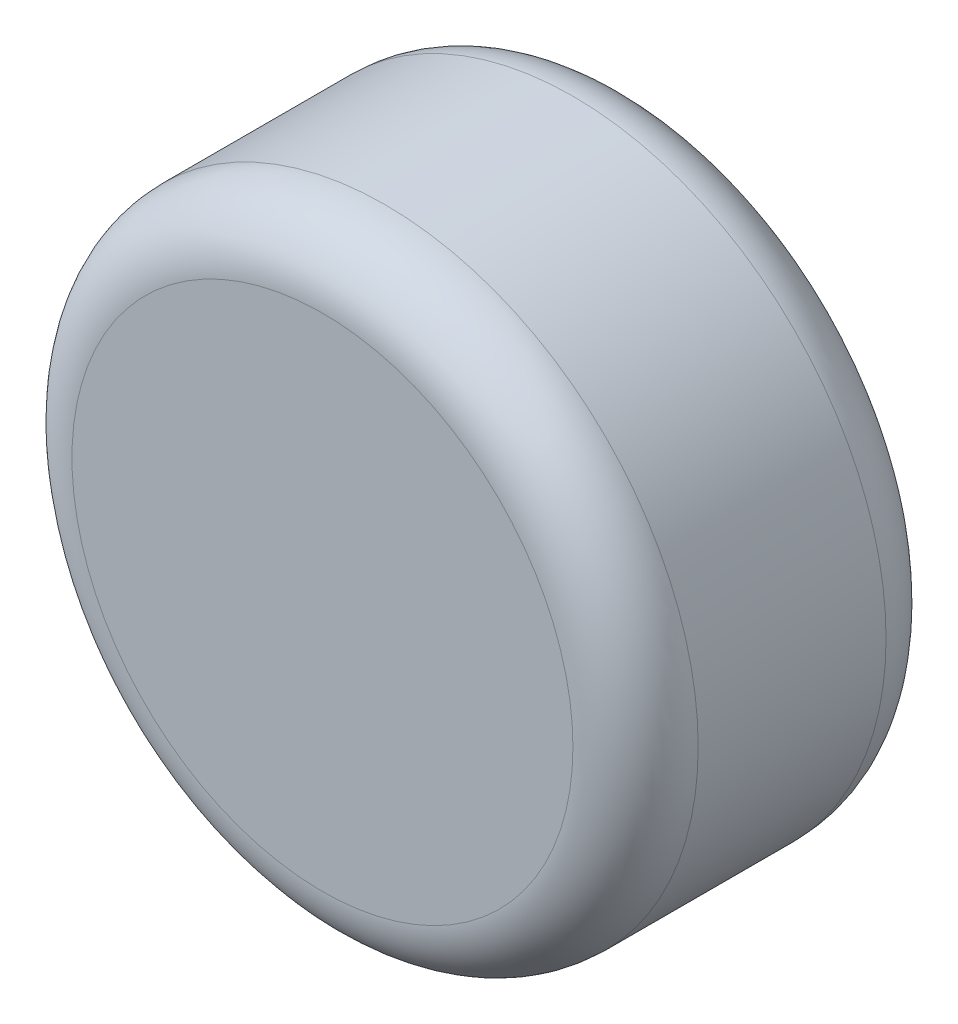
ISO-10303-21;
HEADER;
FILE_DESCRIPTION(('STEP AP214'),'2;1');
FILE_NAME('part.step','',(''),(''),'','','');
FILE_SCHEMA(('AUTOMOTIVE_DESIGN { 1 0 10303 214 1 1 1 1 }'));
ENDSEC;
DATA;
#1=APPLICATION_CONTEXT('core data for automotive mechanical design processes');
#2=APPLICATION_PROTOCOL_DEFINITION('international standard','automotive_design',2000,#1);
#3=PRODUCT_CONTEXT('',#1,'mechanical');
#4=PRODUCT('Part','Part','',(#3));
#5=PRODUCT_RELATED_PRODUCT_CATEGORY('part','',(#4));
#6=PRODUCT_DEFINITION_FORMATION('','',#4);
#7=PRODUCT_DEFINITION_CONTEXT('part definition',#1,'design');
#8=PRODUCT_DEFINITION('design','',#6,#7);
#9=PRODUCT_DEFINITION_SHAPE('','',#8);
#10=(LENGTH_UNIT() NAMED_UNIT(*) SI_UNIT(.MILLI.,.METRE.));
#11=(NAMED_UNIT(*) PLANE_ANGLE_UNIT() SI_UNIT($,.RADIAN.));
#12=(NAMED_UNIT(*) SI_UNIT($,.STERADIAN.) SOLID_ANGLE_UNIT());
#13=UNCERTAINTY_MEASURE_WITH_UNIT(LENGTH_MEASURE(1.E-05),#10,'distance_accuracy_value','');
#14=(GEOMETRIC_REPRESENTATION_CONTEXT(3) GLOBAL_UNCERTAINTY_ASSIGNED_CONTEXT((#13)) GLOBAL_UNIT_ASSIGNED_CONTEXT((#10,
#11,#12)) REPRESENTATION_CONTEXT('',''));
#15=CARTESIAN_POINT('',(0.,0.,0.));
#16=DIRECTION('',(0.,0.,1.));
#17=DIRECTION('',(1.,0.,0.));
#18=AXIS2_PLACEMENT_3D('',#15,#16,#17);
#19=CARTESIAN_POINT('',(0.,0.,50.));
#20=DIRECTION('',(0.,0.,-1.));
#21=DIRECTION('',(-1.,0.,0.));
#22=AXIS2_PLACEMENT_3D('',#19,#20,#21);
#23=CYLINDRICAL_SURFACE('',#22,50.);
#24=CARTESIAN_POINT('',(0.,0.,40.));
#25=DIRECTION('',(0.,0.,1.));
#26=DIRECTION('',(1.,0.,0.));
#27=AXIS2_PLACEMENT_3D('',#24,#25,#26);
#28=CIRCLE('',#27,50.);
#29=CARTESIAN_POINT('',(50.,0.,40.));
#30=VERTEX_POINT('',#29);
#31=EDGE_CURVE('E46',#30,#30,#28,.F.);
#32=ORIENTED_EDGE('',*,*,#31,.T.);
#33=EDGE_LOOP('',(#32));
#34=FACE_BOUND('',#33,.T.);
#35=CARTESIAN_POINT('',(0.,0.,10.));
#36=DIRECTION('',(0.,0.,1.));
#37=DIRECTION('',(1.,0.,0.));
#38=AXIS2_PLACEMENT_3D('',#35,#36,#37);
#39=CIRCLE('',#38,50.);
#40=CARTESIAN_POINT('',(50.,0.,10.));
#41=VERTEX_POINT('',#40);
#42=EDGE_CURVE('E50',#41,#41,#39,.T.);
#43=ORIENTED_EDGE('',*,*,#42,.T.);
#44=EDGE_LOOP('',(#43));
#45=FACE_BOUND('',#44,.T.);
#46=ADVANCED_FACE('F39',(#34,#45),#23,.T.);
#47=CARTESIAN_POINT('',(0.,0.,50.));
#48=DIRECTION('',(0.,0.,1.));
#49=DIRECTION('',(1.,0.,0.));
#50=AXIS2_PLACEMENT_3D('',#47,#48,#49);
#51=PLANE('',#50);
#52=CARTESIAN_POINT('',(0.,0.,50.));
#53=DIRECTION('',(0.,0.,1.));
#54=DIRECTION('',(1.,0.,0.));
#55=AXIS2_PLACEMENT_3D('',#52,#53,#54);
#56=CIRCLE('',#55,40.);
#57=CARTESIAN_POINT('',(40.,0.,50.));
#58=VERTEX_POINT('',#57);
#59=EDGE_CURVE('E54',#58,#58,#56,.T.);
#60=ORIENTED_EDGE('',*,*,#59,.T.);
#61=EDGE_LOOP('',(#60));
#62=FACE_BOUND('',#61,.T.);
#63=ADVANCED_FACE('F60',(#62),#51,.T.);
#64=CARTESIAN_POINT('',(0.,0.,0.));
#65=DIRECTION('',(0.,0.,1.));
#66=DIRECTION('',(1.,0.,0.));
#67=AXIS2_PLACEMENT_3D('',#64,#65,#66);
#68=PLANE('',#67);
#69=CARTESIAN_POINT('',(0.,0.,0.));
#70=DIRECTION('',(0.,0.,1.));
#71=DIRECTION('',(1.,0.,0.));
#72=AXIS2_PLACEMENT_3D('',#69,#70,#71);
#73=CIRCLE('',#72,40.);
#74=CARTESIAN_POINT('',(40.,0.,0.));
#75=VERTEX_POINT('',#74);
#76=EDGE_CURVE('E10',#75,#75,#73,.F.);
#77=ORIENTED_EDGE('',*,*,#76,.T.);
#78=EDGE_LOOP('',(#77));
#79=FACE_BOUND('',#78,.T.);
#80=ADVANCED_FACE('F64',(#79),#68,.F.);
#81=CARTESIAN_POINT('',(0.,0.,40.));
#82=DIRECTION('',(0.,0.,1.));
#83=DIRECTION('',(1.,0.,0.));
#84=AXIS2_PLACEMENT_3D('',#81,#82,#83);
#85=TOROIDAL_SURFACE('',#84,40.,10.);
#86=ORIENTED_EDGE('',*,*,#31,.F.);
#87=EDGE_LOOP('',(#86));
#88=FACE_BOUND('',#87,.T.);
#89=ORIENTED_EDGE('',*,*,#59,.F.);
#90=EDGE_LOOP('',(#89));
#91=FACE_BOUND('',#90,.T.);
#92=ADVANCED_FACE('F62',(#88,#91),#85,.T.);
#93=CARTESIAN_POINT('',(0.,0.,10.));
#94=DIRECTION('',(0.,0.,1.));
#95=DIRECTION('',(1.,0.,0.));
#96=AXIS2_PLACEMENT_3D('',#93,#94,#95);
#97=TOROIDAL_SURFACE('',#96,40.,10.);
#98=ORIENTED_EDGE('',*,*,#76,.F.);
#99=EDGE_LOOP('',(#98));
#100=FACE_BOUND('',#99,.T.);
#101=ORIENTED_EDGE('',*,*,#42,.F.);
#102=EDGE_LOOP('',(#101));
#103=FACE_BOUND('',#102,.T.);
#104=ADVANCED_FACE('F41',(#100,#103),#97,.T.);
#105=CLOSED_SHELL('',(#46,#63,#80,#92,#104));
#106=MANIFOLD_SOLID_BREP('B2',#105);
#107=ADVANCED_BREP_SHAPE_REPRESENTATION('',(#18,#106),#14);
#108=SHAPE_DEFINITION_REPRESENTATION(#9,#107);
ENDSEC;
END-ISO-10303-21;
